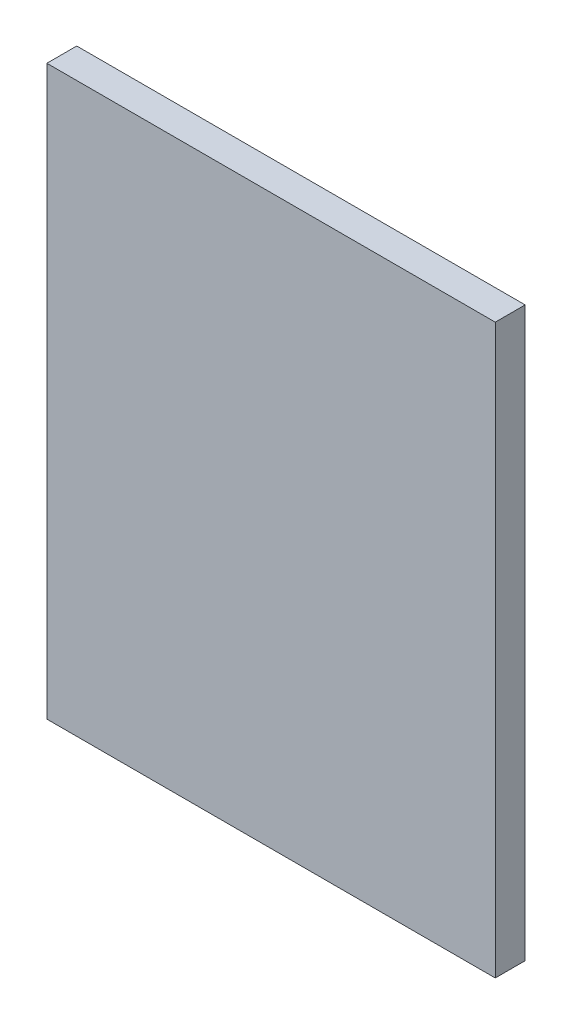
ISO-10303-21;
HEADER;
FILE_DESCRIPTION(('STEP AP214'),'2;1');
FILE_NAME('part.step','',(''),(''),'','','');
FILE_SCHEMA(('AUTOMOTIVE_DESIGN { 1 0 10303 214 1 1 1 1 }'));
ENDSEC;
DATA;
#1=APPLICATION_CONTEXT('core data for automotive mechanical design processes');
#2=APPLICATION_PROTOCOL_DEFINITION('international standard','automotive_design',2000,#1);
#3=PRODUCT_CONTEXT('',#1,'mechanical');
#4=PRODUCT('Part','Part','',(#3));
#5=PRODUCT_RELATED_PRODUCT_CATEGORY('part','',(#4));
#6=PRODUCT_DEFINITION_FORMATION('','',#4);
#7=PRODUCT_DEFINITION_CONTEXT('part definition',#1,'design');
#8=PRODUCT_DEFINITION('design','',#6,#7);
#9=PRODUCT_DEFINITION_SHAPE('','',#8);
#10=(LENGTH_UNIT() NAMED_UNIT(*) SI_UNIT(.MILLI.,.METRE.));
#11=(NAMED_UNIT(*) PLANE_ANGLE_UNIT() SI_UNIT($,.RADIAN.));
#12=(NAMED_UNIT(*) SI_UNIT($,.STERADIAN.) SOLID_ANGLE_UNIT());
#13=UNCERTAINTY_MEASURE_WITH_UNIT(LENGTH_MEASURE(1.E-05),#10,'distance_accuracy_value','');
#14=(GEOMETRIC_REPRESENTATION_CONTEXT(3) GLOBAL_UNCERTAINTY_ASSIGNED_CONTEXT((#13)) GLOBAL_UNIT_ASSIGNED_CONTEXT((#10,
#11,#12)) REPRESENTATION_CONTEXT('',''));
#15=CARTESIAN_POINT('',(0.,0.,0.));
#16=DIRECTION('',(0.,0.,1.));
#17=DIRECTION('',(1.,0.,0.));
#18=AXIS2_PLACEMENT_3D('',#15,#16,#17);
#19=CARTESIAN_POINT('',(0.,0.,5.));
#20=DIRECTION('',(1.,0.,0.));
#21=DIRECTION('',(0.,0.,-1.));
#22=AXIS2_PLACEMENT_3D('',#19,#20,#21);
#23=PLANE('',#22);
#24=DIRECTION('',(0.,-1.,0.));
#25=VECTOR('',#24,1.);
#26=CARTESIAN_POINT('',(0.,0.,0.));
#27=LINE('',#26,#25);
#28=CARTESIAN_POINT('',(0.,95.,0.));
#29=VERTEX_POINT('',#28);
#30=CARTESIAN_POINT('',(0.,0.,0.));
#31=VERTEX_POINT('',#30);
#32=EDGE_CURVE('E107',#29,#31,#27,.T.);
#33=ORIENTED_EDGE('',*,*,#32,.T.);
#34=DIRECTION('',(0.,0.,-1.));
#35=VECTOR('',#34,1.);
#36=CARTESIAN_POINT('',(0.,0.,5.));
#37=LINE('',#36,#35);
#38=CARTESIAN_POINT('',(0.,0.,5.));
#39=VERTEX_POINT('',#38);
#40=EDGE_CURVE('E11',#39,#31,#37,.T.);
#41=ORIENTED_EDGE('',*,*,#40,.F.);
#42=DIRECTION('',(0.,-1.,0.));
#43=VECTOR('',#42,1.);
#44=CARTESIAN_POINT('',(0.,0.,5.));
#45=LINE('',#44,#43);
#46=CARTESIAN_POINT('',(0.,95.,5.));
#47=VERTEX_POINT('',#46);
#48=EDGE_CURVE('E91',#47,#39,#45,.T.);
#49=ORIENTED_EDGE('',*,*,#48,.F.);
#50=DIRECTION('',(0.,0.,-1.));
#51=VECTOR('',#50,1.);
#52=CARTESIAN_POINT('',(0.,95.,5.));
#53=LINE('',#52,#51);
#54=EDGE_CURVE('E103',#47,#29,#53,.T.);
#55=ORIENTED_EDGE('',*,*,#54,.T.);
#56=EDGE_LOOP('',(#33,#41,#49,#55));
#57=FACE_BOUND('',#56,.T.);
#58=ADVANCED_FACE('F39',(#57),#23,.F.);
#59=CARTESIAN_POINT('',(0.,0.,5.));
#60=DIRECTION('',(0.,1.,0.));
#61=DIRECTION('',(0.,0.,1.));
#62=AXIS2_PLACEMENT_3D('',#59,#60,#61);
#63=PLANE('',#62);
#64=DIRECTION('',(1.,0.,0.));
#65=VECTOR('',#64,1.);
#66=CARTESIAN_POINT('',(0.,0.,0.));
#67=LINE('',#66,#65);
#68=CARTESIAN_POINT('',(75.,0.,0.));
#69=VERTEX_POINT('',#68);
#70=EDGE_CURVE('E96',#31,#69,#67,.T.);
#71=ORIENTED_EDGE('',*,*,#70,.T.);
#72=DIRECTION('',(0.,0.,-1.));
#73=VECTOR('',#72,1.);
#74=CARTESIAN_POINT('',(75.,0.,5.));
#75=LINE('',#74,#73);
#76=CARTESIAN_POINT('',(75.,0.,5.));
#77=VERTEX_POINT('',#76);
#78=EDGE_CURVE('E48',#77,#69,#75,.T.);
#79=ORIENTED_EDGE('',*,*,#78,.F.);
#80=DIRECTION('',(1.,0.,0.));
#81=VECTOR('',#80,1.);
#82=CARTESIAN_POINT('',(0.,0.,5.));
#83=LINE('',#82,#81);
#84=EDGE_CURVE('E86',#39,#77,#83,.T.);
#85=ORIENTED_EDGE('',*,*,#84,.F.);
#86=ORIENTED_EDGE('',*,*,#40,.T.);
#87=EDGE_LOOP('',(#71,#79,#85,#86));
#88=FACE_BOUND('',#87,.T.);
#89=ADVANCED_FACE('F95',(#88),#63,.F.);
#90=CARTESIAN_POINT('',(75.,0.,5.));
#91=DIRECTION('',(-1.,0.,0.));
#92=DIRECTION('',(0.,0.,1.));
#93=AXIS2_PLACEMENT_3D('',#90,#91,#92);
#94=PLANE('',#93);
#95=DIRECTION('',(0.,1.,0.));
#96=VECTOR('',#95,1.);
#97=CARTESIAN_POINT('',(75.,0.,0.));
#98=LINE('',#97,#96);
#99=CARTESIAN_POINT('',(75.,95.,0.));
#100=VERTEX_POINT('',#99);
#101=EDGE_CURVE('E73',#69,#100,#98,.T.);
#102=ORIENTED_EDGE('',*,*,#101,.T.);
#103=DIRECTION('',(0.,0.,-1.));
#104=VECTOR('',#103,1.);
#105=CARTESIAN_POINT('',(75.,95.,5.));
#106=LINE('',#105,#104);
#107=CARTESIAN_POINT('',(75.,95.,5.));
#108=VERTEX_POINT('',#107);
#109=EDGE_CURVE('E98',#108,#100,#106,.T.);
#110=ORIENTED_EDGE('',*,*,#109,.F.);
#111=DIRECTION('',(0.,1.,0.));
#112=VECTOR('',#111,1.);
#113=CARTESIAN_POINT('',(75.,0.,5.));
#114=LINE('',#113,#112);
#115=EDGE_CURVE('E89',#77,#108,#114,.T.);
#116=ORIENTED_EDGE('',*,*,#115,.F.);
#117=ORIENTED_EDGE('',*,*,#78,.T.);
#118=EDGE_LOOP('',(#102,#110,#116,#117));
#119=FACE_BOUND('',#118,.T.);
#120=ADVANCED_FACE('F99',(#119),#94,.F.);
#121=CARTESIAN_POINT('',(0.,95.,5.));
#122=DIRECTION('',(0.,-1.,0.));
#123=DIRECTION('',(0.,0.,-1.));
#124=AXIS2_PLACEMENT_3D('',#121,#122,#123);
#125=PLANE('',#124);
#126=DIRECTION('',(-1.,0.,0.));
#127=VECTOR('',#126,1.);
#128=CARTESIAN_POINT('',(0.,95.,0.));
#129=LINE('',#128,#127);
#130=EDGE_CURVE('E79',#100,#29,#129,.T.);
#131=ORIENTED_EDGE('',*,*,#130,.T.);
#132=ORIENTED_EDGE('',*,*,#54,.F.);
#133=DIRECTION('',(-1.,0.,0.));
#134=VECTOR('',#133,1.);
#135=CARTESIAN_POINT('',(0.,95.,5.));
#136=LINE('',#135,#134);
#137=EDGE_CURVE('E56',#108,#47,#136,.T.);
#138=ORIENTED_EDGE('',*,*,#137,.F.);
#139=ORIENTED_EDGE('',*,*,#109,.T.);
#140=EDGE_LOOP('',(#131,#132,#138,#139));
#141=FACE_BOUND('',#140,.T.);
#142=ADVANCED_FACE('F120',(#141),#125,.F.);
#143=CARTESIAN_POINT('',(0.,0.,5.));
#144=DIRECTION('',(0.,0.,-1.));
#145=DIRECTION('',(-1.,0.,0.));
#146=AXIS2_PLACEMENT_3D('',#143,#144,#145);
#147=PLANE('',#146);
#148=ORIENTED_EDGE('',*,*,#48,.T.);
#149=ORIENTED_EDGE('',*,*,#84,.T.);
#150=ORIENTED_EDGE('',*,*,#115,.T.);
#151=ORIENTED_EDGE('',*,*,#137,.T.);
#152=EDGE_LOOP('',(#148,#149,#150,#151));
#153=FACE_BOUND('',#152,.T.);
#154=ADVANCED_FACE('F87',(#153),#147,.F.);
#155=CARTESIAN_POINT('',(0.,0.,0.));
#156=DIRECTION('',(0.,0.,-1.));
#157=DIRECTION('',(-1.,0.,0.));
#158=AXIS2_PLACEMENT_3D('',#155,#156,#157);
#159=PLANE('',#158);
#160=ORIENTED_EDGE('',*,*,#32,.F.);
#161=ORIENTED_EDGE('',*,*,#130,.F.);
#162=ORIENTED_EDGE('',*,*,#101,.F.);
#163=ORIENTED_EDGE('',*,*,#70,.F.);
#164=EDGE_LOOP('',(#160,#161,#162,#163));
#165=FACE_BOUND('',#164,.T.);
#166=ADVANCED_FACE('F123',(#165),#159,.T.);
#167=CLOSED_SHELL('',(#58,#89,#120,#142,#154,#166));
#168=MANIFOLD_SOLID_BREP('B2',#167);
#169=ADVANCED_BREP_SHAPE_REPRESENTATION('',(#18,#168),#14);
#170=SHAPE_DEFINITION_REPRESENTATION(#9,#169);
ENDSEC;
END-ISO-10303-21;
